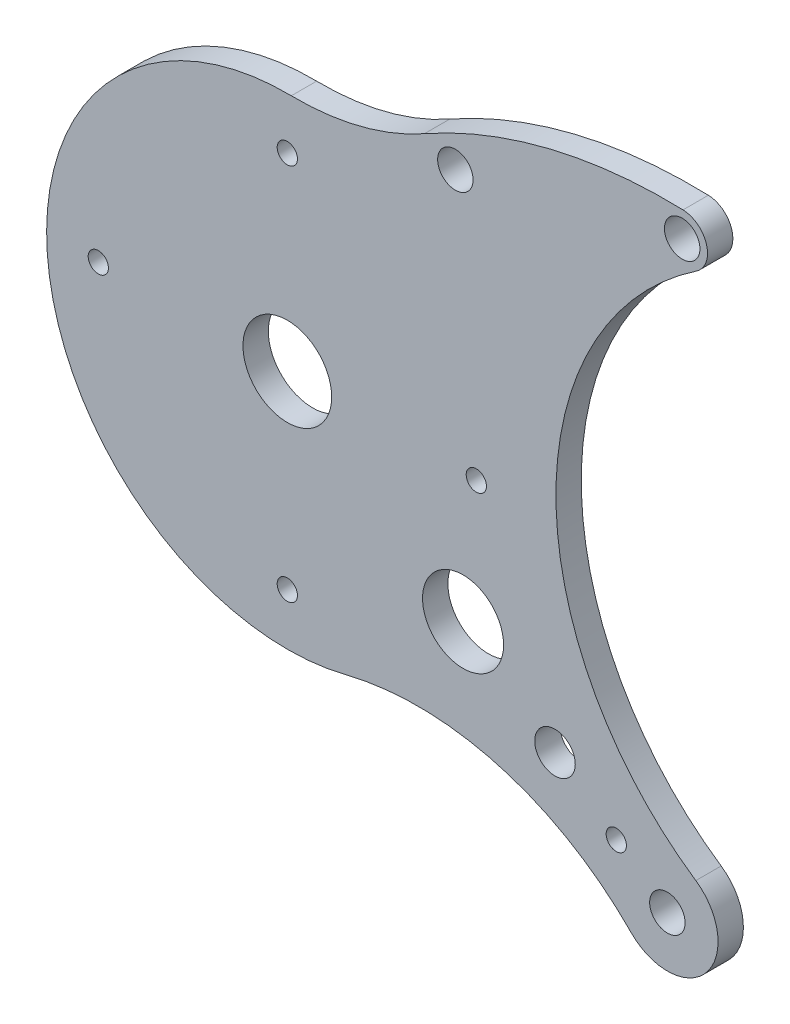
ISO-10303-21;
HEADER;
FILE_DESCRIPTION(('STEP AP214'),'2;1');
FILE_NAME('part.step','',(''),(''),'','','');
FILE_SCHEMA(('AUTOMOTIVE_DESIGN { 1 0 10303 214 1 1 1 1 }'));
ENDSEC;
DATA;
#1=APPLICATION_CONTEXT('core data for automotive mechanical design processes');
#2=APPLICATION_PROTOCOL_DEFINITION('international standard','automotive_design',2000,#1);
#3=PRODUCT_CONTEXT('',#1,'mechanical');
#4=PRODUCT('Part','Part','',(#3));
#5=PRODUCT_RELATED_PRODUCT_CATEGORY('part','',(#4));
#6=PRODUCT_DEFINITION_FORMATION('','',#4);
#7=PRODUCT_DEFINITION_CONTEXT('part definition',#1,'design');
#8=PRODUCT_DEFINITION('design','',#6,#7);
#9=PRODUCT_DEFINITION_SHAPE('','',#8);
#10=(LENGTH_UNIT() NAMED_UNIT(*) SI_UNIT(.MILLI.,.METRE.));
#11=(NAMED_UNIT(*) PLANE_ANGLE_UNIT() SI_UNIT($,.RADIAN.));
#12=(NAMED_UNIT(*) SI_UNIT($,.STERADIAN.) SOLID_ANGLE_UNIT());
#13=UNCERTAINTY_MEASURE_WITH_UNIT(LENGTH_MEASURE(1.E-05),#10,'distance_accuracy_value','');
#14=(GEOMETRIC_REPRESENTATION_CONTEXT(3) GLOBAL_UNCERTAINTY_ASSIGNED_CONTEXT((#13)) GLOBAL_UNIT_ASSIGNED_CONTEXT((#10,
#11,#12)) REPRESENTATION_CONTEXT('',''));
#15=CARTESIAN_POINT('',(0.,0.,0.));
#16=DIRECTION('',(0.,0.,1.));
#17=DIRECTION('',(1.,0.,0.));
#18=AXIS2_PLACEMENT_3D('',#15,#16,#17);
#19=CARTESIAN_POINT('',(1.64350741132432,99.2954072076834,10.));
#20=DIRECTION('',(0.,0.,-1.));
#21=DIRECTION('',(-1.,0.,0.));
#22=AXIS2_PLACEMENT_3D('',#19,#20,#21);
#23=PLANE('',#22);
#24=CARTESIAN_POINT('',(69.3595004144295,-50.8636336372483,10.));
#25=DIRECTION('',(0.,0.,1.));
#26=DIRECTION('',(1.,0.,0.));
#27=AXIS2_PLACEMENT_3D('',#24,#25,#26);
#28=CIRCLE('',#27,16.);
#29=CARTESIAN_POINT('',(85.3595004144295,-50.8636336372483,10.));
#30=VERTEX_POINT('',#29);
#31=EDGE_CURVE('E223',#30,#30,#28,.T.);
#32=ORIENTED_EDGE('',*,*,#31,.F.);
#33=EDGE_LOOP('',(#32));
#34=FACE_BOUND('',#33,.T.);
#35=CARTESIAN_POINT('',(105.647725227936,-77.4749985004866,10.));
#36=DIRECTION('',(0.,0.,1.));
#37=DIRECTION('',(1.,0.,0.));
#38=AXIS2_PLACEMENT_3D('',#35,#36,#37);
#39=CIRCLE('',#38,8.00000000000003);
#40=CARTESIAN_POINT('',(113.647725227936,-77.4749985004866,10.));
#41=VERTEX_POINT('',#40);
#42=EDGE_CURVE('E217',#41,#41,#39,.T.);
#43=ORIENTED_EDGE('',*,*,#42,.F.);
#44=EDGE_LOOP('',(#43));
#45=FACE_BOUND('',#44,.T.);
#46=CARTESIAN_POINT('',(129.839875103607,-95.2159084093121,10.));
#47=DIRECTION('',(0.,0.,1.));
#48=DIRECTION('',(1.,0.,0.));
#49=AXIS2_PLACEMENT_3D('',#46,#47,#48);
#50=CIRCLE('',#49,3.99999999999999);
#51=CARTESIAN_POINT('',(133.839875103607,-95.2159084093121,10.));
#52=VERTEX_POINT('',#51);
#53=EDGE_CURVE('E211',#52,#52,#50,.T.);
#54=ORIENTED_EDGE('',*,*,#53,.F.);
#55=EDGE_LOOP('',(#54));
#56=FACE_BOUND('',#55,.T.);
#57=CARTESIAN_POINT('',(3.28701482264863,198.590814415367,10.));
#58=DIRECTION('',(0.,0.,-1.));
#59=DIRECTION('',(-1.,0.,0.));
#60=AXIS2_PLACEMENT_3D('',#57,#58,#59);
#61=CIRCLE('',#60,103.618015387836);
#62=CARTESIAN_POINT('',(54.1220768623376,108.299676531657,10.));
#63=VERTEX_POINT('',#62);
#64=CARTESIAN_POINT('',(1.57219579271892,94.9869896374731,10.));
#65=VERTEX_POINT('',#64);
#66=EDGE_CURVE('E139',#63,#65,#61,.T.);
#67=ORIENTED_EDGE('',*,*,#66,.T.);
#68=CARTESIAN_POINT('',(0.,0.,10.));
#69=DIRECTION('',(0.,0.,1.));
#70=DIRECTION('',(1.,0.,0.));
#71=AXIS2_PLACEMENT_3D('',#68,#69,#70);
#72=CIRCLE('',#71,95.0000000000003);
#73=CARTESIAN_POINT('',(23.0489440185832,-92.161522229335,10.));
#74=VERTEX_POINT('',#73);
#75=EDGE_CURVE('E92',#65,#74,#72,.T.);
#76=ORIENTED_EDGE('',*,*,#75,.T.);
#77=CARTESIAN_POINT('',(51.6098838506755,-206.362836142191,10.));
#78=DIRECTION('',(0.,0.,-1.));
#79=DIRECTION('',(-1.,0.,0.));
#80=AXIS2_PLACEMENT_3D('',#77,#78,#79);
#81=CIRCLE('',#80,117.718594043231);
#82=CARTESIAN_POINT('',(135.711425994018,-123.994164958138,10.));
#83=VERTEX_POINT('',#82);
#84=EDGE_CURVE('E151',#74,#83,#81,.T.);
#85=ORIENTED_EDGE('',*,*,#84,.T.);
#86=CARTESIAN_POINT('',(150.,-110.,10.));
#87=DIRECTION('',(0.,0.,1.));
#88=DIRECTION('',(1.,0.,0.));
#89=AXIS2_PLACEMENT_3D('',#86,#87,#88);
#90=CIRCLE('',#89,20.);
#91=CARTESIAN_POINT('',(161.225161537401,-93.4471830657358,10.));
#92=VERTEX_POINT('',#91);
#93=EDGE_CURVE('E108',#83,#92,#90,.T.);
#94=ORIENTED_EDGE('',*,*,#93,.T.);
#95=CARTESIAN_POINT('',(231.853596556625,10.7027261655513,10.));
#96=DIRECTION('',(0.,0.,-1.));
#97=DIRECTION('',(-1.,0.,0.));
#98=AXIS2_PLACEMENT_3D('',#95,#96,#97);
#99=CIRCLE('',#98,125.839498672516);
#100=CARTESIAN_POINT('',(161.441107801879,114.998751274435,10.));
#101=VERTEX_POINT('',#100);
#102=EDGE_CURVE('E102',#92,#101,#99,.T.);
#103=ORIENTED_EDGE('',*,*,#102,.T.);
#104=CARTESIAN_POINT('',(155.845687484926,123.286771030482,10.));
#105=DIRECTION('',(0.,0.,1.));
#106=DIRECTION('',(1.,0.,0.));
#107=AXIS2_PLACEMENT_3D('',#104,#105,#106);
#108=CIRCLE('',#107,10.0000000000001);
#109=CARTESIAN_POINT('',(156.171848546842,133.281450563199,10.));
#110=VERTEX_POINT('',#109);
#111=EDGE_CURVE('E106',#101,#110,#108,.T.);
#112=ORIENTED_EDGE('',*,*,#111,.T.);
#113=CARTESIAN_POINT('',(149.810304549101,-61.6578018946996,10.));
#114=DIRECTION('',(0.,0.,1.));
#115=DIRECTION('',(-1.,0.,0.));
#116=AXIS2_PLACEMENT_3D('',#113,#114,#115);
#117=CIRCLE('',#116,195.043024460962);
#118=EDGE_CURVE('E52',#110,#63,#117,.T.);
#119=ORIENTED_EDGE('',*,*,#118,.T.);
#120=EDGE_LOOP('',(#67,#76,#85,#94,#103,#112,#119));
#121=FACE_BOUND('',#120,.T.);
#122=CARTESIAN_POINT('',(66.3210360944153,102.089205287982,10.));
#123=DIRECTION('',(0.,0.,1.));
#124=DIRECTION('',(1.,0.,0.));
#125=AXIS2_PLACEMENT_3D('',#122,#123,#124);
#126=CIRCLE('',#125,7.);
#127=CARTESIAN_POINT('',(73.3210360944154,102.089205287982,10.));
#128=VERTEX_POINT('',#127);
#129=EDGE_CURVE('E130',#128,#128,#126,.T.);
#130=ORIENTED_EDGE('',*,*,#129,.F.);
#131=EDGE_LOOP('',(#130));
#132=FACE_BOUND('',#131,.T.);
#133=CARTESIAN_POINT('',(155.845687484926,123.286771030482,10.));
#134=DIRECTION('',(0.,0.,1.));
#135=DIRECTION('',(1.,0.,0.));
#136=AXIS2_PLACEMENT_3D('',#133,#134,#135);
#137=CIRCLE('',#136,7.00000000000002);
#138=CARTESIAN_POINT('',(162.845687484926,123.286771030482,10.));
#139=VERTEX_POINT('',#138);
#140=EDGE_CURVE('E166',#139,#139,#137,.T.);
#141=ORIENTED_EDGE('',*,*,#140,.F.);
#142=EDGE_LOOP('',(#141));
#143=FACE_BOUND('',#142,.T.);
#144=CARTESIAN_POINT('',(150.,-110.,10.));
#145=DIRECTION('',(0.,0.,1.));
#146=DIRECTION('',(1.,0.,0.));
#147=AXIS2_PLACEMENT_3D('',#144,#145,#146);
#148=CIRCLE('',#147,7.00000000000002);
#149=CARTESIAN_POINT('',(157.,-110.,10.));
#150=VERTEX_POINT('',#149);
#151=EDGE_CURVE('E172',#150,#150,#148,.T.);
#152=ORIENTED_EDGE('',*,*,#151,.F.);
#153=EDGE_LOOP('',(#152));
#154=FACE_BOUND('',#153,.T.);
#155=CARTESIAN_POINT('',(0.,74.6,10.));
#156=DIRECTION('',(0.,0.,1.));
#157=DIRECTION('',(1.,0.,0.));
#158=AXIS2_PLACEMENT_3D('',#155,#156,#157);
#159=CIRCLE('',#158,4.);
#160=CARTESIAN_POINT('',(4.,74.6,10.));
#161=VERTEX_POINT('',#160);
#162=EDGE_CURVE('E178',#161,#161,#159,.T.);
#163=ORIENTED_EDGE('',*,*,#162,.F.);
#164=EDGE_LOOP('',(#163));
#165=FACE_BOUND('',#164,.T.);
#166=CARTESIAN_POINT('',(74.6,0.,10.));
#167=DIRECTION('',(0.,0.,1.));
#168=DIRECTION('',(1.,0.,0.));
#169=AXIS2_PLACEMENT_3D('',#166,#167,#168);
#170=CIRCLE('',#169,4.00000000000001);
#171=CARTESIAN_POINT('',(78.6,0.,10.));
#172=VERTEX_POINT('',#171);
#173=EDGE_CURVE('E184',#172,#172,#170,.T.);
#174=ORIENTED_EDGE('',*,*,#173,.F.);
#175=EDGE_LOOP('',(#174));
#176=FACE_BOUND('',#175,.T.);
#177=CARTESIAN_POINT('',(0.,-74.6,10.));
#178=DIRECTION('',(0.,0.,1.));
#179=DIRECTION('',(1.,0.,0.));
#180=AXIS2_PLACEMENT_3D('',#177,#178,#179);
#181=CIRCLE('',#180,4.);
#182=CARTESIAN_POINT('',(4.,-74.6,10.));
#183=VERTEX_POINT('',#182);
#184=EDGE_CURVE('E190',#183,#183,#181,.T.);
#185=ORIENTED_EDGE('',*,*,#184,.F.);
#186=EDGE_LOOP('',(#185));
#187=FACE_BOUND('',#186,.T.);
#188=CARTESIAN_POINT('',(-74.6,0.,10.));
#189=DIRECTION('',(0.,0.,1.));
#190=DIRECTION('',(1.,0.,0.));
#191=AXIS2_PLACEMENT_3D('',#188,#189,#190);
#192=CIRCLE('',#191,4.00000000000001);
#193=CARTESIAN_POINT('',(-70.6,0.,10.));
#194=VERTEX_POINT('',#193);
#195=EDGE_CURVE('E196',#194,#194,#192,.T.);
#196=ORIENTED_EDGE('',*,*,#195,.F.);
#197=EDGE_LOOP('',(#196));
#198=FACE_BOUND('',#197,.T.);
#199=CARTESIAN_POINT('',(0.,0.,10.));
#200=DIRECTION('',(0.,0.,1.));
#201=DIRECTION('',(1.,0.,0.));
#202=AXIS2_PLACEMENT_3D('',#199,#200,#201);
#203=CIRCLE('',#202,17.5);
#204=CARTESIAN_POINT('',(17.5,0.,10.));
#205=VERTEX_POINT('',#204);
#206=EDGE_CURVE('E202',#205,#205,#203,.T.);
#207=ORIENTED_EDGE('',*,*,#206,.F.);
#208=EDGE_LOOP('',(#207));
#209=FACE_BOUND('',#208,.T.);
#210=ADVANCED_FACE('F35',(#34,#45,#56,#121,#132,#143,#154,#165,#176,#187,#198,#209),#23,.F.);
#211=CARTESIAN_POINT('',(1.64350741132432,99.2954072076834,0.));
#212=DIRECTION('',(0.,0.,-1.));
#213=DIRECTION('',(-1.,0.,0.));
#214=AXIS2_PLACEMENT_3D('',#211,#212,#213);
#215=PLANE('',#214);
#216=CARTESIAN_POINT('',(69.3595004144295,-50.8636336372483,0.));
#217=DIRECTION('',(0.,0.,1.));
#218=DIRECTION('',(1.,0.,0.));
#219=AXIS2_PLACEMENT_3D('',#216,#217,#218);
#220=CIRCLE('',#219,16.);
#221=CARTESIAN_POINT('',(85.3595004144295,-50.8636336372483,0.));
#222=VERTEX_POINT('',#221);
#223=EDGE_CURVE('E220',#222,#222,#220,.T.);
#224=ORIENTED_EDGE('',*,*,#223,.T.);
#225=EDGE_LOOP('',(#224));
#226=FACE_BOUND('',#225,.T.);
#227=CARTESIAN_POINT('',(105.647725227936,-77.4749985004866,0.));
#228=DIRECTION('',(0.,0.,1.));
#229=DIRECTION('',(1.,0.,0.));
#230=AXIS2_PLACEMENT_3D('',#227,#228,#229);
#231=CIRCLE('',#230,8.00000000000003);
#232=CARTESIAN_POINT('',(113.647725227936,-77.4749985004866,0.));
#233=VERTEX_POINT('',#232);
#234=EDGE_CURVE('E214',#233,#233,#231,.T.);
#235=ORIENTED_EDGE('',*,*,#234,.T.);
#236=EDGE_LOOP('',(#235));
#237=FACE_BOUND('',#236,.T.);
#238=CARTESIAN_POINT('',(129.839875103607,-95.2159084093121,0.));
#239=DIRECTION('',(0.,0.,1.));
#240=DIRECTION('',(1.,0.,0.));
#241=AXIS2_PLACEMENT_3D('',#238,#239,#240);
#242=CIRCLE('',#241,3.99999999999999);
#243=CARTESIAN_POINT('',(133.839875103607,-95.2159084093121,0.));
#244=VERTEX_POINT('',#243);
#245=EDGE_CURVE('E208',#244,#244,#242,.T.);
#246=ORIENTED_EDGE('',*,*,#245,.T.);
#247=EDGE_LOOP('',(#246));
#248=FACE_BOUND('',#247,.T.);
#249=CARTESIAN_POINT('',(-74.6,0.,0.));
#250=DIRECTION('',(0.,0.,1.));
#251=DIRECTION('',(1.,0.,0.));
#252=AXIS2_PLACEMENT_3D('',#249,#250,#251);
#253=CIRCLE('',#252,4.00000000000001);
#254=CARTESIAN_POINT('',(-70.6,0.,0.));
#255=VERTEX_POINT('',#254);
#256=EDGE_CURVE('E199',#255,#255,#253,.T.);
#257=ORIENTED_EDGE('',*,*,#256,.T.);
#258=EDGE_LOOP('',(#257));
#259=FACE_BOUND('',#258,.T.);
#260=CARTESIAN_POINT('',(74.6,0.,0.));
#261=DIRECTION('',(0.,0.,1.));
#262=DIRECTION('',(1.,0.,0.));
#263=AXIS2_PLACEMENT_3D('',#260,#261,#262);
#264=CIRCLE('',#263,4.00000000000001);
#265=CARTESIAN_POINT('',(78.6,0.,0.));
#266=VERTEX_POINT('',#265);
#267=EDGE_CURVE('E187',#266,#266,#264,.T.);
#268=ORIENTED_EDGE('',*,*,#267,.T.);
#269=EDGE_LOOP('',(#268));
#270=FACE_BOUND('',#269,.T.);
#271=CARTESIAN_POINT('',(150.,-110.,0.));
#272=DIRECTION('',(0.,0.,1.));
#273=DIRECTION('',(1.,0.,0.));
#274=AXIS2_PLACEMENT_3D('',#271,#272,#273);
#275=CIRCLE('',#274,7.00000000000002);
#276=CARTESIAN_POINT('',(157.,-110.,0.));
#277=VERTEX_POINT('',#276);
#278=EDGE_CURVE('E175',#277,#277,#275,.T.);
#279=ORIENTED_EDGE('',*,*,#278,.T.);
#280=EDGE_LOOP('',(#279));
#281=FACE_BOUND('',#280,.T.);
#282=CARTESIAN_POINT('',(66.3210360944153,102.089205287982,0.));
#283=DIRECTION('',(0.,0.,1.));
#284=DIRECTION('',(1.,0.,0.));
#285=AXIS2_PLACEMENT_3D('',#282,#283,#284);
#286=CIRCLE('',#285,7.);
#287=CARTESIAN_POINT('',(73.3210360944154,102.089205287982,0.));
#288=VERTEX_POINT('',#287);
#289=EDGE_CURVE('E163',#288,#288,#286,.T.);
#290=ORIENTED_EDGE('',*,*,#289,.T.);
#291=EDGE_LOOP('',(#290));
#292=FACE_BOUND('',#291,.T.);
#293=CARTESIAN_POINT('',(3.28701482264863,198.590814415367,0.));
#294=DIRECTION('',(0.,0.,-1.));
#295=DIRECTION('',(-1.,0.,0.));
#296=AXIS2_PLACEMENT_3D('',#293,#294,#295);
#297=CIRCLE('',#296,103.618015387836);
#298=CARTESIAN_POINT('',(54.1220768623376,108.299676531657,0.));
#299=VERTEX_POINT('',#298);
#300=CARTESIAN_POINT('',(1.57219579271892,94.9869896374731,0.));
#301=VERTEX_POINT('',#300);
#302=EDGE_CURVE('E126',#299,#301,#297,.T.);
#303=ORIENTED_EDGE('',*,*,#302,.F.);
#304=CARTESIAN_POINT('',(149.810304549101,-61.6578018946996,0.));
#305=DIRECTION('',(0.,0.,1.));
#306=DIRECTION('',(-1.,0.,0.));
#307=AXIS2_PLACEMENT_3D('',#304,#305,#306);
#308=CIRCLE('',#307,195.043024460962);
#309=CARTESIAN_POINT('',(156.171848546842,133.281450563199,0.));
#310=VERTEX_POINT('',#309);
#311=EDGE_CURVE('E84',#310,#299,#308,.T.);
#312=ORIENTED_EDGE('',*,*,#311,.F.);
#313=CARTESIAN_POINT('',(155.845687484926,123.286771030482,0.));
#314=DIRECTION('',(0.,0.,1.));
#315=DIRECTION('',(1.,0.,0.));
#316=AXIS2_PLACEMENT_3D('',#313,#314,#315);
#317=CIRCLE('',#316,10.0000000000001);
#318=CARTESIAN_POINT('',(161.441107801879,114.998751274435,0.));
#319=VERTEX_POINT('',#318);
#320=EDGE_CURVE('E78',#319,#310,#317,.T.);
#321=ORIENTED_EDGE('',*,*,#320,.F.);
#322=CARTESIAN_POINT('',(231.853596556625,10.7027261655513,0.));
#323=DIRECTION('',(0.,0.,-1.));
#324=DIRECTION('',(-1.,0.,0.));
#325=AXIS2_PLACEMENT_3D('',#322,#323,#324);
#326=CIRCLE('',#325,125.839498672516);
#327=CARTESIAN_POINT('',(161.225161537401,-93.4471830657358,0.));
#328=VERTEX_POINT('',#327);
#329=EDGE_CURVE('E116',#328,#319,#326,.T.);
#330=ORIENTED_EDGE('',*,*,#329,.F.);
#331=CARTESIAN_POINT('',(150.,-110.,0.));
#332=DIRECTION('',(0.,0.,1.));
#333=DIRECTION('',(1.,0.,0.));
#334=AXIS2_PLACEMENT_3D('',#331,#332,#333);
#335=CIRCLE('',#334,20.);
#336=CARTESIAN_POINT('',(135.711425994018,-123.994164958138,0.));
#337=VERTEX_POINT('',#336);
#338=EDGE_CURVE('E134',#337,#328,#335,.T.);
#339=ORIENTED_EDGE('',*,*,#338,.F.);
#340=CARTESIAN_POINT('',(51.6098838506755,-206.362836142191,0.));
#341=DIRECTION('',(0.,0.,-1.));
#342=DIRECTION('',(-1.,0.,0.));
#343=AXIS2_PLACEMENT_3D('',#340,#341,#342);
#344=CIRCLE('',#343,117.718594043231);
#345=CARTESIAN_POINT('',(23.0489440185832,-92.161522229335,0.));
#346=VERTEX_POINT('',#345);
#347=EDGE_CURVE('E132',#346,#337,#344,.T.);
#348=ORIENTED_EDGE('',*,*,#347,.F.);
#349=CARTESIAN_POINT('',(0.,0.,0.));
#350=DIRECTION('',(0.,0.,1.));
#351=DIRECTION('',(1.,0.,0.));
#352=AXIS2_PLACEMENT_3D('',#349,#350,#351);
#353=CIRCLE('',#352,95.0000000000003);
#354=EDGE_CURVE('E129',#301,#346,#353,.T.);
#355=ORIENTED_EDGE('',*,*,#354,.F.);
#356=EDGE_LOOP('',(#303,#312,#321,#330,#339,#348,#355));
#357=FACE_BOUND('',#356,.T.);
#358=CARTESIAN_POINT('',(155.845687484926,123.286771030482,0.));
#359=DIRECTION('',(0.,0.,1.));
#360=DIRECTION('',(1.,0.,0.));
#361=AXIS2_PLACEMENT_3D('',#358,#359,#360);
#362=CIRCLE('',#361,7.00000000000002);
#363=CARTESIAN_POINT('',(162.845687484926,123.286771030482,0.));
#364=VERTEX_POINT('',#363);
#365=EDGE_CURVE('E169',#364,#364,#362,.T.);
#366=ORIENTED_EDGE('',*,*,#365,.T.);
#367=EDGE_LOOP('',(#366));
#368=FACE_BOUND('',#367,.T.);
#369=CARTESIAN_POINT('',(0.,74.6,0.));
#370=DIRECTION('',(0.,0.,1.));
#371=DIRECTION('',(1.,0.,0.));
#372=AXIS2_PLACEMENT_3D('',#369,#370,#371);
#373=CIRCLE('',#372,4.);
#374=CARTESIAN_POINT('',(4.,74.6,0.));
#375=VERTEX_POINT('',#374);
#376=EDGE_CURVE('E181',#375,#375,#373,.T.);
#377=ORIENTED_EDGE('',*,*,#376,.T.);
#378=EDGE_LOOP('',(#377));
#379=FACE_BOUND('',#378,.T.);
#380=CARTESIAN_POINT('',(0.,-74.6,0.));
#381=DIRECTION('',(0.,0.,1.));
#382=DIRECTION('',(1.,0.,0.));
#383=AXIS2_PLACEMENT_3D('',#380,#381,#382);
#384=CIRCLE('',#383,4.);
#385=CARTESIAN_POINT('',(4.,-74.6,0.));
#386=VERTEX_POINT('',#385);
#387=EDGE_CURVE('E193',#386,#386,#384,.T.);
#388=ORIENTED_EDGE('',*,*,#387,.T.);
#389=EDGE_LOOP('',(#388));
#390=FACE_BOUND('',#389,.T.);
#391=CARTESIAN_POINT('',(0.,0.,0.));
#392=DIRECTION('',(0.,0.,1.));
#393=DIRECTION('',(1.,0.,0.));
#394=AXIS2_PLACEMENT_3D('',#391,#392,#393);
#395=CIRCLE('',#394,17.5);
#396=CARTESIAN_POINT('',(17.5,0.,0.));
#397=VERTEX_POINT('',#396);
#398=EDGE_CURVE('E205',#397,#397,#395,.T.);
#399=ORIENTED_EDGE('',*,*,#398,.T.);
#400=EDGE_LOOP('',(#399));
#401=FACE_BOUND('',#400,.T.);
#402=ADVANCED_FACE('F155',(#226,#237,#248,#259,#270,#281,#292,#357,#368,#379,#390,#401),#215,.T.);
#403=CARTESIAN_POINT('',(3.28701482264863,198.590814415367,10.));
#404=DIRECTION('',(0.,0.,-1.));
#405=DIRECTION('',(-1.,0.,0.));
#406=AXIS2_PLACEMENT_3D('',#403,#404,#405);
#407=CYLINDRICAL_SURFACE('',#406,103.618015387836);
#408=ORIENTED_EDGE('',*,*,#302,.T.);
#409=DIRECTION('',(0.,0.,-1.));
#410=VECTOR('',#409,1.);
#411=CARTESIAN_POINT('',(1.57219579271892,94.9869896374731,10.));
#412=LINE('',#411,#410);
#413=EDGE_CURVE('E11',#65,#301,#412,.T.);
#414=ORIENTED_EDGE('',*,*,#413,.F.);
#415=ORIENTED_EDGE('',*,*,#66,.F.);
#416=DIRECTION('',(0.,0.,-1.));
#417=VECTOR('',#416,1.);
#418=CARTESIAN_POINT('',(54.1220768623376,108.299676531657,10.));
#419=LINE('',#418,#417);
#420=EDGE_CURVE('E122',#63,#299,#419,.T.);
#421=ORIENTED_EDGE('',*,*,#420,.T.);
#422=EDGE_LOOP('',(#408,#414,#415,#421));
#423=FACE_BOUND('',#422,.T.);
#424=ADVANCED_FACE('F37',(#423),#407,.F.);
#425=CARTESIAN_POINT('',(0.,0.,10.));
#426=DIRECTION('',(0.,0.,-1.));
#427=DIRECTION('',(-1.,0.,0.));
#428=AXIS2_PLACEMENT_3D('',#425,#426,#427);
#429=CYLINDRICAL_SURFACE('',#428,95.0000000000003);
#430=ORIENTED_EDGE('',*,*,#354,.T.);
#431=DIRECTION('',(0.,0.,-1.));
#432=VECTOR('',#431,1.);
#433=CARTESIAN_POINT('',(23.0489440185832,-92.161522229335,10.));
#434=LINE('',#433,#432);
#435=EDGE_CURVE('E44',#74,#346,#434,.T.);
#436=ORIENTED_EDGE('',*,*,#435,.F.);
#437=ORIENTED_EDGE('',*,*,#75,.F.);
#438=ORIENTED_EDGE('',*,*,#413,.T.);
#439=EDGE_LOOP('',(#430,#436,#437,#438));
#440=FACE_BOUND('',#439,.T.);
#441=ADVANCED_FACE('F300',(#440),#429,.T.);
#442=CARTESIAN_POINT('',(51.6098838506755,-206.362836142191,10.));
#443=DIRECTION('',(0.,0.,-1.));
#444=DIRECTION('',(-1.,0.,0.));
#445=AXIS2_PLACEMENT_3D('',#442,#443,#444);
#446=CYLINDRICAL_SURFACE('',#445,117.718594043231);
#447=ORIENTED_EDGE('',*,*,#347,.T.);
#448=DIRECTION('',(0.,0.,-1.));
#449=VECTOR('',#448,1.);
#450=CARTESIAN_POINT('',(135.711425994018,-123.994164958138,10.));
#451=LINE('',#450,#449);
#452=EDGE_CURVE('E143',#83,#337,#451,.T.);
#453=ORIENTED_EDGE('',*,*,#452,.F.);
#454=ORIENTED_EDGE('',*,*,#84,.F.);
#455=ORIENTED_EDGE('',*,*,#435,.T.);
#456=EDGE_LOOP('',(#447,#453,#454,#455));
#457=FACE_BOUND('',#456,.T.);
#458=ADVANCED_FACE('F149',(#457),#446,.F.);
#459=CARTESIAN_POINT('',(150.,-110.,10.));
#460=DIRECTION('',(0.,0.,-1.));
#461=DIRECTION('',(-1.,0.,0.));
#462=AXIS2_PLACEMENT_3D('',#459,#460,#461);
#463=CYLINDRICAL_SURFACE('',#462,20.);
#464=ORIENTED_EDGE('',*,*,#338,.T.);
#465=DIRECTION('',(0.,0.,-1.));
#466=VECTOR('',#465,1.);
#467=CARTESIAN_POINT('',(161.225161537401,-93.4471830657358,10.));
#468=LINE('',#467,#466);
#469=EDGE_CURVE('E117',#92,#328,#468,.T.);
#470=ORIENTED_EDGE('',*,*,#469,.F.);
#471=ORIENTED_EDGE('',*,*,#93,.F.);
#472=ORIENTED_EDGE('',*,*,#452,.T.);
#473=EDGE_LOOP('',(#464,#470,#471,#472));
#474=FACE_BOUND('',#473,.T.);
#475=ADVANCED_FACE('F158',(#474),#463,.T.);
#476=CARTESIAN_POINT('',(231.853596556625,10.7027261655513,10.));
#477=DIRECTION('',(0.,0.,-1.));
#478=DIRECTION('',(-1.,0.,0.));
#479=AXIS2_PLACEMENT_3D('',#476,#477,#478);
#480=CYLINDRICAL_SURFACE('',#479,125.839498672516);
#481=ORIENTED_EDGE('',*,*,#329,.T.);
#482=DIRECTION('',(0.,0.,-1.));
#483=VECTOR('',#482,1.);
#484=CARTESIAN_POINT('',(161.441107801879,114.998751274435,10.));
#485=LINE('',#484,#483);
#486=EDGE_CURVE('E113',#101,#319,#485,.T.);
#487=ORIENTED_EDGE('',*,*,#486,.F.);
#488=ORIENTED_EDGE('',*,*,#102,.F.);
#489=ORIENTED_EDGE('',*,*,#469,.T.);
#490=EDGE_LOOP('',(#481,#487,#488,#489));
#491=FACE_BOUND('',#490,.T.);
#492=ADVANCED_FACE('F114',(#491),#480,.F.);
#493=CARTESIAN_POINT('',(155.845687484926,123.286771030482,10.));
#494=DIRECTION('',(0.,0.,-1.));
#495=DIRECTION('',(-1.,0.,0.));
#496=AXIS2_PLACEMENT_3D('',#493,#494,#495);
#497=CYLINDRICAL_SURFACE('',#496,10.0000000000001);
#498=ORIENTED_EDGE('',*,*,#320,.T.);
#499=DIRECTION('',(0.,0.,-1.));
#500=VECTOR('',#499,1.);
#501=CARTESIAN_POINT('',(156.171848546842,133.281450563199,10.));
#502=LINE('',#501,#500);
#503=EDGE_CURVE('E118',#110,#310,#502,.T.);
#504=ORIENTED_EDGE('',*,*,#503,.F.);
#505=ORIENTED_EDGE('',*,*,#111,.F.);
#506=ORIENTED_EDGE('',*,*,#486,.T.);
#507=EDGE_LOOP('',(#498,#504,#505,#506));
#508=FACE_BOUND('',#507,.T.);
#509=ADVANCED_FACE('F120',(#508),#497,.T.);
#510=CARTESIAN_POINT('',(149.810304549101,-61.6578018946996,10.));
#511=DIRECTION('',(0.,0.,-1.));
#512=DIRECTION('',(-1.,0.,0.));
#513=AXIS2_PLACEMENT_3D('',#510,#511,#512);
#514=CYLINDRICAL_SURFACE('',#513,195.043024460962);
#515=ORIENTED_EDGE('',*,*,#311,.T.);
#516=ORIENTED_EDGE('',*,*,#420,.F.);
#517=ORIENTED_EDGE('',*,*,#118,.F.);
#518=ORIENTED_EDGE('',*,*,#503,.T.);
#519=EDGE_LOOP('',(#515,#516,#517,#518));
#520=FACE_BOUND('',#519,.T.);
#521=ADVANCED_FACE('F286',(#520),#514,.T.);
#522=CARTESIAN_POINT('',(66.3210360944153,102.089205287982,10.));
#523=DIRECTION('',(0.,0.,-1.));
#524=DIRECTION('',(-1.,0.,0.));
#525=AXIS2_PLACEMENT_3D('',#522,#523,#524);
#526=CYLINDRICAL_SURFACE('',#525,7.);
#527=ORIENTED_EDGE('',*,*,#129,.T.);
#528=EDGE_LOOP('',(#527));
#529=FACE_BOUND('',#528,.T.);
#530=ORIENTED_EDGE('',*,*,#289,.F.);
#531=EDGE_LOOP('',(#530));
#532=FACE_BOUND('',#531,.T.);
#533=ADVANCED_FACE('F283',(#529,#532),#526,.F.);
#534=CARTESIAN_POINT('',(155.845687484926,123.286771030482,10.));
#535=DIRECTION('',(0.,0.,-1.));
#536=DIRECTION('',(-1.,0.,0.));
#537=AXIS2_PLACEMENT_3D('',#534,#535,#536);
#538=CYLINDRICAL_SURFACE('',#537,7.00000000000002);
#539=ORIENTED_EDGE('',*,*,#140,.T.);
#540=EDGE_LOOP('',(#539));
#541=FACE_BOUND('',#540,.T.);
#542=ORIENTED_EDGE('',*,*,#365,.F.);
#543=EDGE_LOOP('',(#542));
#544=FACE_BOUND('',#543,.T.);
#545=ADVANCED_FACE('F279',(#541,#544),#538,.F.);
#546=CARTESIAN_POINT('',(150.,-110.,10.));
#547=DIRECTION('',(0.,0.,-1.));
#548=DIRECTION('',(-1.,0.,0.));
#549=AXIS2_PLACEMENT_3D('',#546,#547,#548);
#550=CYLINDRICAL_SURFACE('',#549,7.00000000000002);
#551=ORIENTED_EDGE('',*,*,#151,.T.);
#552=EDGE_LOOP('',(#551));
#553=FACE_BOUND('',#552,.T.);
#554=ORIENTED_EDGE('',*,*,#278,.F.);
#555=EDGE_LOOP('',(#554));
#556=FACE_BOUND('',#555,.T.);
#557=ADVANCED_FACE('F275',(#553,#556),#550,.F.);
#558=CARTESIAN_POINT('',(0.,74.6,10.));
#559=DIRECTION('',(0.,0.,-1.));
#560=DIRECTION('',(-1.,0.,0.));
#561=AXIS2_PLACEMENT_3D('',#558,#559,#560);
#562=CYLINDRICAL_SURFACE('',#561,4.);
#563=ORIENTED_EDGE('',*,*,#162,.T.);
#564=EDGE_LOOP('',(#563));
#565=FACE_BOUND('',#564,.T.);
#566=ORIENTED_EDGE('',*,*,#376,.F.);
#567=EDGE_LOOP('',(#566));
#568=FACE_BOUND('',#567,.T.);
#569=ADVANCED_FACE('F271',(#565,#568),#562,.F.);
#570=CARTESIAN_POINT('',(74.6,0.,10.));
#571=DIRECTION('',(0.,0.,-1.));
#572=DIRECTION('',(-1.,0.,0.));
#573=AXIS2_PLACEMENT_3D('',#570,#571,#572);
#574=CYLINDRICAL_SURFACE('',#573,4.00000000000001);
#575=ORIENTED_EDGE('',*,*,#173,.T.);
#576=EDGE_LOOP('',(#575));
#577=FACE_BOUND('',#576,.T.);
#578=ORIENTED_EDGE('',*,*,#267,.F.);
#579=EDGE_LOOP('',(#578));
#580=FACE_BOUND('',#579,.T.);
#581=ADVANCED_FACE('F267',(#577,#580),#574,.F.);
#582=CARTESIAN_POINT('',(0.,-74.6,10.));
#583=DIRECTION('',(0.,0.,-1.));
#584=DIRECTION('',(-1.,0.,0.));
#585=AXIS2_PLACEMENT_3D('',#582,#583,#584);
#586=CYLINDRICAL_SURFACE('',#585,4.);
#587=ORIENTED_EDGE('',*,*,#184,.T.);
#588=EDGE_LOOP('',(#587));
#589=FACE_BOUND('',#588,.T.);
#590=ORIENTED_EDGE('',*,*,#387,.F.);
#591=EDGE_LOOP('',(#590));
#592=FACE_BOUND('',#591,.T.);
#593=ADVANCED_FACE('F263',(#589,#592),#586,.F.);
#594=CARTESIAN_POINT('',(-74.6,0.,10.));
#595=DIRECTION('',(0.,0.,-1.));
#596=DIRECTION('',(-1.,0.,0.));
#597=AXIS2_PLACEMENT_3D('',#594,#595,#596);
#598=CYLINDRICAL_SURFACE('',#597,4.00000000000001);
#599=ORIENTED_EDGE('',*,*,#195,.T.);
#600=EDGE_LOOP('',(#599));
#601=FACE_BOUND('',#600,.T.);
#602=ORIENTED_EDGE('',*,*,#256,.F.);
#603=EDGE_LOOP('',(#602));
#604=FACE_BOUND('',#603,.T.);
#605=ADVANCED_FACE('F256',(#601,#604),#598,.F.);
#606=CARTESIAN_POINT('',(0.,0.,10.));
#607=DIRECTION('',(0.,0.,-1.));
#608=DIRECTION('',(-1.,0.,0.));
#609=AXIS2_PLACEMENT_3D('',#606,#607,#608);
#610=CYLINDRICAL_SURFACE('',#609,17.5);
#611=ORIENTED_EDGE('',*,*,#206,.T.);
#612=EDGE_LOOP('',(#611));
#613=FACE_BOUND('',#612,.T.);
#614=ORIENTED_EDGE('',*,*,#398,.F.);
#615=EDGE_LOOP('',(#614));
#616=FACE_BOUND('',#615,.T.);
#617=ADVANCED_FACE('F247',(#613,#616),#610,.F.);
#618=CARTESIAN_POINT('',(129.839875103607,-95.2159084093121,0.));
#619=DIRECTION('',(0.,0.,1.));
#620=DIRECTION('',(1.,0.,0.));
#621=AXIS2_PLACEMENT_3D('',#618,#619,#620);
#622=CYLINDRICAL_SURFACE('',#621,3.99999999999999);
#623=ORIENTED_EDGE('',*,*,#245,.F.);
#624=EDGE_LOOP('',(#623));
#625=FACE_BOUND('',#624,.T.);
#626=ORIENTED_EDGE('',*,*,#53,.T.);
#627=EDGE_LOOP('',(#626));
#628=FACE_BOUND('',#627,.T.);
#629=ADVANCED_FACE('F245',(#625,#628),#622,.F.);
#630=CARTESIAN_POINT('',(105.647725227936,-77.4749985004866,0.));
#631=DIRECTION('',(0.,0.,1.));
#632=DIRECTION('',(1.,0.,0.));
#633=AXIS2_PLACEMENT_3D('',#630,#631,#632);
#634=CYLINDRICAL_SURFACE('',#633,8.00000000000003);
#635=ORIENTED_EDGE('',*,*,#234,.F.);
#636=EDGE_LOOP('',(#635));
#637=FACE_BOUND('',#636,.T.);
#638=ORIENTED_EDGE('',*,*,#42,.T.);
#639=EDGE_LOOP('',(#638));
#640=FACE_BOUND('',#639,.T.);
#641=ADVANCED_FACE('F234',(#637,#640),#634,.F.);
#642=CARTESIAN_POINT('',(69.3595004144295,-50.8636336372483,0.));
#643=DIRECTION('',(0.,0.,1.));
#644=DIRECTION('',(1.,0.,0.));
#645=AXIS2_PLACEMENT_3D('',#642,#643,#644);
#646=CYLINDRICAL_SURFACE('',#645,16.);
#647=ORIENTED_EDGE('',*,*,#223,.F.);
#648=EDGE_LOOP('',(#647));
#649=FACE_BOUND('',#648,.T.);
#650=ORIENTED_EDGE('',*,*,#31,.T.);
#651=EDGE_LOOP('',(#650));
#652=FACE_BOUND('',#651,.T.);
#653=ADVANCED_FACE('F231',(#649,#652),#646,.F.);
#654=CLOSED_SHELL('',(#210,#402,#424,#441,#458,#475,#492,#509,#521,#533,#545,#557,#569,#581,
#593,#605,#617,#629,#641,#653));
#655=MANIFOLD_SOLID_BREP('B2',#654);
#656=ADVANCED_BREP_SHAPE_REPRESENTATION('',(#18,#655),#14);
#657=SHAPE_DEFINITION_REPRESENTATION(#9,#656);
ENDSEC;
END-ISO-10303-21;
